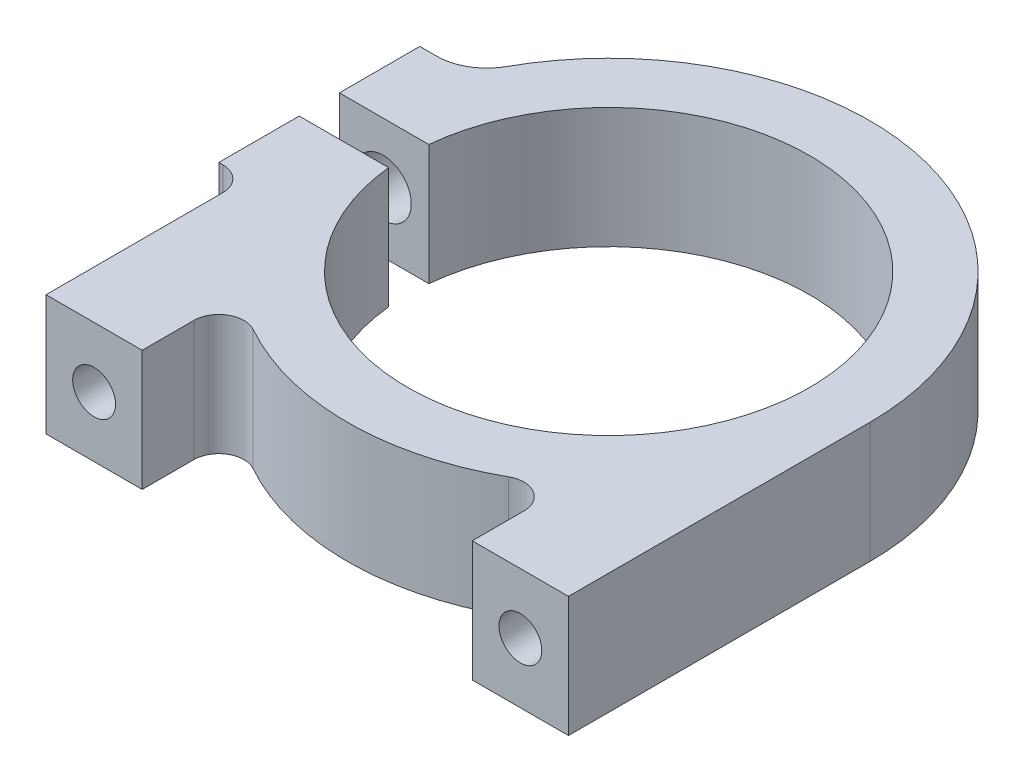
ISO-10303-21;
HEADER;
FILE_DESCRIPTION(('STEP AP214'),'2;1');
FILE_NAME('part.step','',(''),(''),'','','');
FILE_SCHEMA(('AUTOMOTIVE_DESIGN { 1 0 10303 214 1 1 1 1 }'));
ENDSEC;
DATA;
#1=APPLICATION_CONTEXT('core data for automotive mechanical design processes');
#2=APPLICATION_PROTOCOL_DEFINITION('international standard','automotive_design',2000,#1);
#3=PRODUCT_CONTEXT('',#1,'mechanical');
#4=PRODUCT('Part','Part','',(#3));
#5=PRODUCT_RELATED_PRODUCT_CATEGORY('part','',(#4));
#6=PRODUCT_DEFINITION_FORMATION('','',#4);
#7=PRODUCT_DEFINITION_CONTEXT('part definition',#1,'design');
#8=PRODUCT_DEFINITION('design','',#6,#7);
#9=PRODUCT_DEFINITION_SHAPE('','',#8);
#10=(LENGTH_UNIT() NAMED_UNIT(*) SI_UNIT(.MILLI.,.METRE.));
#11=(NAMED_UNIT(*) PLANE_ANGLE_UNIT() SI_UNIT($,.RADIAN.));
#12=(NAMED_UNIT(*) SI_UNIT($,.STERADIAN.) SOLID_ANGLE_UNIT());
#13=UNCERTAINTY_MEASURE_WITH_UNIT(LENGTH_MEASURE(1.E-05),#10,'distance_accuracy_value','');
#14=(GEOMETRIC_REPRESENTATION_CONTEXT(3) GLOBAL_UNCERTAINTY_ASSIGNED_CONTEXT((#13)) GLOBAL_UNIT_ASSIGNED_CONTEXT((#10,
#11,#12)) REPRESENTATION_CONTEXT('',''));
#15=CARTESIAN_POINT('',(0.,0.,0.));
#16=DIRECTION('',(0.,0.,1.));
#17=DIRECTION('',(1.,0.,0.));
#18=AXIS2_PLACEMENT_3D('',#15,#16,#17);
#19=CARTESIAN_POINT('',(-18.288,0.,0.));
#20=DIRECTION('',(1.,0.,0.));
#21=DIRECTION('',(0.,0.,-1.));
#22=AXIS2_PLACEMENT_3D('',#19,#20,#21);
#23=PLANE('',#22);
#24=DIRECTION('',(0.,0.,1.));
#25=VECTOR('',#24,1.);
#26=CARTESIAN_POINT('',(-18.288,0.,19.05));
#27=LINE('',#26,#25);
#28=CARTESIAN_POINT('',(-18.288,0.,-6.35));
#29=VERTEX_POINT('',#28);
#30=CARTESIAN_POINT('',(-18.288,0.,-1.27));
#31=VERTEX_POINT('',#30);
#32=EDGE_CURVE('E354',#29,#31,#27,.T.);
#33=ORIENTED_EDGE('',*,*,#32,.T.);
#34=DIRECTION('',(0.,1.,0.));
#35=VECTOR('',#34,1.);
#36=CARTESIAN_POINT('',(-18.288,0.,-1.27));
#37=LINE('',#36,#35);
#38=CARTESIAN_POINT('',(-18.288,7.62,-1.27));
#39=VERTEX_POINT('',#38);
#40=EDGE_CURVE('E253',#31,#39,#37,.T.);
#41=ORIENTED_EDGE('',*,*,#40,.T.);
#42=DIRECTION('',(0.,0.,1.));
#43=VECTOR('',#42,1.);
#44=CARTESIAN_POINT('',(-18.288,7.62,19.05));
#45=LINE('',#44,#43);
#46=CARTESIAN_POINT('',(-18.288,7.62,-6.35));
#47=VERTEX_POINT('',#46);
#48=EDGE_CURVE('E341',#47,#39,#45,.T.);
#49=ORIENTED_EDGE('',*,*,#48,.F.);
#50=DIRECTION('',(0.,-1.,0.));
#51=VECTOR('',#50,1.);
#52=CARTESIAN_POINT('',(-18.288,0.,-6.35));
#53=LINE('',#52,#51);
#54=EDGE_CURVE('E350',#47,#29,#53,.T.);
#55=ORIENTED_EDGE('',*,*,#54,.T.);
#56=EDGE_LOOP('',(#33,#41,#49,#55));
#57=FACE_BOUND('',#56,.T.);
#58=ADVANCED_FACE('F43',(#57),#23,.F.);
#59=CARTESIAN_POINT('',(0.,0.,19.05));
#60=DIRECTION('',(0.,0.,-1.));
#61=DIRECTION('',(-1.,0.,0.));
#62=AXIS2_PLACEMENT_3D('',#59,#60,#61);
#63=PLANE('',#62);
#64=CARTESIAN_POINT('',(-13.4703841816038,3.81,19.05));
#65=DIRECTION('',(0.,0.,1.));
#66=DIRECTION('',(1.,0.,0.));
#67=AXIS2_PLACEMENT_3D('',#64,#65,#66);
#68=CIRCLE('',#67,1.35254999999998);
#69=CARTESIAN_POINT('',(-12.1178341816038,3.81,19.05));
#70=VERTEX_POINT('',#69);
#71=EDGE_CURVE('E213',#70,#70,#68,.T.);
#72=ORIENTED_EDGE('',*,*,#71,.F.);
#73=EDGE_LOOP('',(#72));
#74=FACE_BOUND('',#73,.T.);
#75=DIRECTION('',(1.,0.,0.));
#76=VECTOR('',#75,1.);
#77=CARTESIAN_POINT('',(16.51,7.62,19.05));
#78=LINE('',#77,#76);
#79=CARTESIAN_POINT('',(-16.51,7.62,19.05));
#80=VERTEX_POINT('',#79);
#81=CARTESIAN_POINT('',(-10.42924,7.62,19.05));
#82=VERTEX_POINT('',#81);
#83=EDGE_CURVE('E345',#80,#82,#78,.T.);
#84=ORIENTED_EDGE('',*,*,#83,.F.);
#85=DIRECTION('',(0.,1.,0.));
#86=VECTOR('',#85,1.);
#87=CARTESIAN_POINT('',(-16.51,0.,19.05));
#88=LINE('',#87,#86);
#89=CARTESIAN_POINT('',(-16.51,0.,19.05));
#90=VERTEX_POINT('',#89);
#91=EDGE_CURVE('E283',#90,#80,#88,.T.);
#92=ORIENTED_EDGE('',*,*,#91,.F.);
#93=DIRECTION('',(1.,0.,0.));
#94=VECTOR('',#93,1.);
#95=CARTESIAN_POINT('',(16.51,0.,19.05));
#96=LINE('',#95,#94);
#97=CARTESIAN_POINT('',(-10.42924,0.,19.05));
#98=VERTEX_POINT('',#97);
#99=EDGE_CURVE('E358',#90,#98,#96,.T.);
#100=ORIENTED_EDGE('',*,*,#99,.T.);
#101=DIRECTION('',(0.,1.,0.));
#102=VECTOR('',#101,1.);
#103=CARTESIAN_POINT('',(-10.42924,0.,19.05));
#104=LINE('',#103,#102);
#105=EDGE_CURVE('E306',#98,#82,#104,.T.);
#106=ORIENTED_EDGE('',*,*,#105,.T.);
#107=EDGE_LOOP('',(#84,#92,#100,#106));
#108=FACE_BOUND('',#107,.T.);
#109=ADVANCED_FACE('F630',(#74,#108),#63,.F.);
#110=CARTESIAN_POINT('',(0.,-5.92424712516283,-6.35000000000001));
#111=DIRECTION('',(0.,0.,1.));
#112=DIRECTION('',(1.,0.,0.));
#113=AXIS2_PLACEMENT_3D('',#110,#111,#112);
#114=PLANE('',#113);
#115=CARTESIAN_POINT('',(-15.52194,3.81,-6.35));
#116=DIRECTION('',(0.,0.,-1.));
#117=DIRECTION('',(-1.,0.,0.));
#118=AXIS2_PLACEMENT_3D('',#115,#116,#117);
#119=CIRCLE('',#118,1.77799999999998);
#120=CARTESIAN_POINT('',(-17.29994,3.81,-6.35));
#121=VERTEX_POINT('',#120);
#122=EDGE_CURVE('E230',#121,#121,#119,.T.);
#123=ORIENTED_EDGE('',*,*,#122,.F.);
#124=EDGE_LOOP('',(#123));
#125=FACE_BOUND('',#124,.T.);
#126=CARTESIAN_POINT('',(-15.52194,3.81,-6.35));
#127=DIRECTION('',(0.,0.,1.));
#128=DIRECTION('',(1.,0.,0.));
#129=AXIS2_PLACEMENT_3D('',#126,#127,#128);
#130=CIRCLE('',#129,3.1115);
#131=CARTESIAN_POINT('',(-17.2271181571382,1.20734756403802,-6.35));
#132=VERTEX_POINT('',#131);
#133=CARTESIAN_POINT('',(-15.24,6.90870006396231,-6.35));
#134=VERTEX_POINT('',#133);
#135=EDGE_CURVE('E58',#132,#134,#130,.T.);
#136=ORIENTED_EDGE('',*,*,#135,.F.);
#137=DIRECTION('',(0.,-1.,0.));
#138=VECTOR('',#137,1.);
#139=CARTESIAN_POINT('',(-17.2271181571382,-5.92424712516283,-6.35));
#140=LINE('',#139,#138);
#141=CARTESIAN_POINT('',(-17.2271181571382,0.,-6.34999999999998));
#142=VERTEX_POINT('',#141);
#143=EDGE_CURVE('E612',#132,#142,#140,.T.);
#144=ORIENTED_EDGE('',*,*,#143,.T.);
#145=DIRECTION('',(1.,0.,0.));
#146=VECTOR('',#145,1.);
#147=CARTESIAN_POINT('',(-15.24,0.,-6.35));
#148=LINE('',#147,#146);
#149=EDGE_CURVE('E368',#29,#142,#148,.T.);
#150=ORIENTED_EDGE('',*,*,#149,.F.);
#151=ORIENTED_EDGE('',*,*,#54,.F.);
#152=DIRECTION('',(-1.,0.,0.));
#153=VECTOR('',#152,1.);
#154=CARTESIAN_POINT('',(-18.288,7.62,-6.35));
#155=LINE('',#154,#153);
#156=CARTESIAN_POINT('',(-17.2271181571382,7.62,-6.35));
#157=VERTEX_POINT('',#156);
#158=EDGE_CURVE('E338',#157,#47,#155,.T.);
#159=ORIENTED_EDGE('',*,*,#158,.F.);
#160=DIRECTION('',(0.,-1.,0.));
#161=VECTOR('',#160,1.);
#162=CARTESIAN_POINT('',(-17.2271181571382,-5.92424712516283,-6.35));
#163=LINE('',#162,#161);
#164=CARTESIAN_POINT('',(-17.2271181571382,6.9215,-6.35));
#165=VERTEX_POINT('',#164);
#166=EDGE_CURVE('E609',#157,#165,#163,.T.);
#167=ORIENTED_EDGE('',*,*,#166,.T.);
#168=DIRECTION('',(1.,0.,0.));
#169=VECTOR('',#168,1.);
#170=CARTESIAN_POINT('',(0.,6.9215,-6.35000000000001));
#171=LINE('',#170,#169);
#172=CARTESIAN_POINT('',(-15.52194,6.9215,-6.35));
#173=VERTEX_POINT('',#172);
#174=EDGE_CURVE('E607',#165,#173,#171,.T.);
#175=ORIENTED_EDGE('',*,*,#174,.T.);
#176=EDGE_CURVE('E449',#134,#173,#130,.T.);
#177=ORIENTED_EDGE('',*,*,#176,.F.);
#178=EDGE_LOOP('',(#136,#144,#150,#151,#159,#167,#175,#177));
#179=FACE_BOUND('',#178,.T.);
#180=ADVANCED_FACE('F627',(#125,#179),#114,.F.);
#181=CARTESIAN_POINT('',(0.,7.62,0.));
#182=DIRECTION('',(0.,-1.,0.));
#183=DIRECTION('',(0.,0.,-1.));
#184=AXIS2_PLACEMENT_3D('',#181,#182,#183);
#185=CYLINDRICAL_SURFACE('',#184,16.51);
#186=CARTESIAN_POINT('',(0.,0.,0.));
#187=DIRECTION('',(0.,-1.,0.));
#188=DIRECTION('',(0.,0.,1.));
#189=AXIS2_PLACEMENT_3D('',#186,#187,#188);
#190=CIRCLE('',#189,16.51);
#191=CARTESIAN_POINT('',(-14.4485507124385,0.,-7.98870967741936));
#192=VERTEX_POINT('',#191);
#193=CARTESIAN_POINT('',(16.51,0.,0.));
#194=VERTEX_POINT('',#193);
#195=EDGE_CURVE('E366',#192,#194,#190,.T.);
#196=ORIENTED_EDGE('',*,*,#195,.F.);
#197=DIRECTION('',(0.,-1.,0.));
#198=VECTOR('',#197,1.);
#199=CARTESIAN_POINT('',(-14.4485507124385,7.62,-7.98870967741936));
#200=LINE('',#199,#198);
#201=CARTESIAN_POINT('',(-14.4485507124385,0.889508998927032,-7.98870967741936));
#202=VERTEX_POINT('',#201);
#203=EDGE_CURVE('E604',#192,#202,#200,.F.);
#204=ORIENTED_EDGE('',*,*,#203,.T.);
#205=CARTESIAN_POINT('',(-15.52194,0.698499999999998,-5.62578693485633));
#206=CARTESIAN_POINT('',(-15.4854731339468,0.698501935198527,-5.72640178156838));
#207=CARTESIAN_POINT('',(-15.4480285974644,0.69914085929907,-5.82665954634316));
#208=CARTESIAN_POINT('',(-15.3712011060332,0.701915400420493,-6.02641939895405));
#209=CARTESIAN_POINT('',(-15.3318179624468,0.704051163361149,-6.12592141215946));
#210=CARTESIAN_POINT('',(-15.2106768864915,0.713046610535485,-6.42349717554516));
#211=CARTESIAN_POINT('',(-15.1260359831156,0.722495780826319,-6.62034081475627));
#212=CARTESIAN_POINT('',(-14.9468649019323,0.75072169890199,-7.01568023187725));
#213=CARTESIAN_POINT('',(-14.8521205006136,0.76975857320611,-7.21406105926228));
#214=CARTESIAN_POINT('',(-14.6554690209219,0.819856649529013,-7.60560697659743));
#215=CARTESIAN_POINT('',(-14.5535663919439,0.850910435294968,-7.79877520500814));
#216=CARTESIAN_POINT('',(-14.3595494275865,0.9222214640834,-8.14968004072023));
#217=CARTESIAN_POINT('',(-14.2683121497909,0.96035307355544,-8.30832771265046));
#218=CARTESIAN_POINT('',(-14.0822534115297,1.04967488154899,-8.61992773006835));
#219=CARTESIAN_POINT('',(-13.9874302518527,1.10087133875475,-8.77287730554011));
#220=CARTESIAN_POINT('',(-13.7967412399011,1.21818243562499,-9.06977436141784));
#221=CARTESIAN_POINT('',(-13.7008978732906,1.28412913625055,-9.21380152659813));
#222=CARTESIAN_POINT('',(-13.5094500807721,1.43385484181993,-9.49227674828532));
#223=CARTESIAN_POINT('',(-13.4138455100027,1.51760780905324,-9.6267384131404));
#224=CARTESIAN_POINT('',(-13.2365611111634,1.69519940127717,-9.86881340706386));
#225=CARTESIAN_POINT('',(-13.1545224753835,1.78685207129358,-9.97774640400457));
#226=CARTESIAN_POINT('',(-12.996299262153,1.98818890453879,-10.1829808278039));
#227=CARTESIAN_POINT('',(-12.9201214643911,2.09789350291981,-10.2792677142872));
#228=CARTESIAN_POINT('',(-12.7772807105275,2.33762783682913,-10.4563037337745));
#229=CARTESIAN_POINT('',(-12.7107388187093,2.467879277736,-10.5368589768487));
#230=CARTESIAN_POINT('',(-12.6232878352005,2.67644661705286,-10.6411837741476));
#231=CARTESIAN_POINT('',(-12.5962046351142,2.7481418993286,-10.6731996099616));
#232=CARTESIAN_POINT('',(-12.5468475198645,2.8955079943709,-10.7311767730148));
#233=CARTESIAN_POINT('',(-12.5245719125048,2.97117739661182,-10.7571402308536));
#234=CARTESIAN_POINT('',(-12.4744795290881,3.16971065975737,-10.8152528518619));
#235=CARTESIAN_POINT('',(-12.450648244193,3.29507343818656,-10.842602478196));
#236=CARTESIAN_POINT('',(-12.4186330826282,3.55029101457252,-10.8792585437766));
#237=CARTESIAN_POINT('',(-12.410438788011,3.68014276304775,-10.888576996123));
#238=CARTESIAN_POINT('',(-12.4104412127409,3.93993779721104,-10.8885742406293));
#239=CARTESIAN_POINT('',(-12.4186481038264,4.06988108971105,-10.8792414656128));
#240=CARTESIAN_POINT('',(-12.4506891198985,4.32519988926556,-10.8425555602648));
#241=CARTESIAN_POINT('',(-12.4745298905957,4.45057342985745,-10.815194766489));
#242=CARTESIAN_POINT('',(-12.5355616535082,4.69229431706295,-10.7443906067067));
#243=CARTESIAN_POINT('',(-12.5726724718238,4.80869087354691,-10.701043775554));
#244=CARTESIAN_POINT('',(-12.6575604300473,5.03104704827857,-10.6004995421567));
#245=CARTESIAN_POINT('',(-12.7053417729742,5.13700253011818,-10.543296681399));
#246=CARTESIAN_POINT('',(-12.8285594920242,5.37569694377296,-10.3933028350189));
#247=CARTESIAN_POINT('',(-12.9075964945359,5.50326005145146,-10.2952563560163));
#248=CARTESIAN_POINT('',(-13.0745661498142,5.73678785555393,-10.0823692291421));
#249=CARTESIAN_POINT('',(-13.1625186030926,5.84270282819026,-9.96749093566345));
#250=CARTESIAN_POINT('',(-13.3203855676183,6.01100486649576,-9.75502194917827));
#251=CARTESIAN_POINT('',(-13.3894277950024,6.07769461852777,-9.66011039948918));
#252=CARTESIAN_POINT('',(-13.5284513079876,6.20082935415329,-9.46443363653409));
#253=CARTESIAN_POINT('',(-13.5984331200514,6.25726831281466,-9.36366502639403));
#254=CARTESIAN_POINT('',(-13.7382257859873,6.36095544800978,-9.15733602313892));
#255=CARTESIAN_POINT('',(-13.8080365054791,6.40819785127885,-9.05177267100614));
#256=CARTESIAN_POINT('',(-13.9466143605487,6.49448145996615,-8.83676430956491));
#257=CARTESIAN_POINT('',(-14.0153818148847,6.53352521919709,-8.72732052143447));
#258=CARTESIAN_POINT('',(-14.1458476590917,6.60155346436489,-8.51407335114997));
#259=CARTESIAN_POINT('',(-14.2076707247308,6.63109352331868,-8.41052139939679));
#260=CARTESIAN_POINT('',(-14.3295036379936,6.68470807727247,-8.20122382523562));
#261=CARTESIAN_POINT('',(-14.3895163435949,6.70879162513591,-8.09548215872386));
#262=CARTESIAN_POINT('',(-14.5518362553677,6.76845586575748,-7.80190233252084));
#263=CARTESIAN_POINT('',(-14.6521270688316,6.79912268111244,-7.61193962071112));
#264=CARTESIAN_POINT('',(-14.8457885817442,6.84878933086103,-7.22697450196913));
#265=CARTESIAN_POINT('',(-14.9391553112033,6.86778251685641,-7.03196928897042));
#266=CARTESIAN_POINT('',(-15.1187451427038,6.89661114338037,-6.63708412002955));
#267=CARTESIAN_POINT('',(-15.2049372228497,6.90640852535362,-6.4371873880516));
#268=CARTESIAN_POINT('',(-15.3694193041687,6.9188534923508,-6.03394419503236));
#269=CARTESIAN_POINT('',(-15.447708246365,6.9215001204341,-5.83059727593784));
#270=CARTESIAN_POINT('',(-15.5964919856263,6.92149987904635,-5.42009305243084));
#271=CARTESIAN_POINT('',(-15.6669517021781,6.91883012444324,-5.21292309452853));
#272=CARTESIAN_POINT('',(-15.7995650941259,6.90980153948929,-4.7960089518498));
#273=CARTESIAN_POINT('',(-15.8617179987305,6.90344236708842,-4.58626453015706));
#274=CARTESIAN_POINT('',(-15.9771442662327,6.88856964177688,-4.16629240786288));
#275=CARTESIAN_POINT('',(-16.0304867177044,6.88007431334647,-3.95608300151204));
#276=CARTESIAN_POINT('',(-16.1288330264427,6.86214123416271,-3.53381376626691));
#277=CARTESIAN_POINT('',(-16.1738388451176,6.85270370589242,-3.3217543849526));
#278=CARTESIAN_POINT('',(-16.2146510364849,6.84341122664435,-3.10888915289983));
#279=B_SPLINE_CURVE_WITH_KNOTS('',3,(#205,#206,#207,#208,#209,#210,#211,#212,#213,#214,#215,
#216,#217,#218,#219,#220,#221,#222,#223,#224,#225,#226,#227,#228,#229,#230,#231,#232,#233,#234,
#235,#236,#237,#238,#239,#240,#241,#242,#243,#244,#245,#246,#247,#248,#249,#250,#251,#252,#253,
#254,#255,#256,#257,#258,#259,#260,#261,#262,#263,#264,#265,#266,#267,#268,#269,#270,#271,#272,
#273,#274,#275,#276,#277,#278),.UNSPECIFIED.,.F.,.F.,(4,2,2,2,2,2,2,2,2,2,2,2,2,2,2,2,2,2,2,2,2,
2,2,2,2,2,2,2,2,2,2,2,2,2,2,2,4),(0.,0.321044843708941,0.642120988923724,1.28522901489469,
1.94680948495497,2.60798230924182,3.16832940357913,3.72894543642441,4.28347704413504,
4.83720328215382,5.32880159982016,5.82096029438146,6.31884729005702,6.56762858894505,
6.81632217743627,7.2055950302454,7.59460844426166,7.98386319270059,8.37328351442394,
8.76038975410506,9.14764874106464,9.68245135557348,10.2184688901509,10.6229008925865,
11.027569837202,11.4324920048673,11.8372878547669,12.209624373644,12.5813385524531,
13.2316834536493,13.8823983987253,14.5357947257388,15.1892784883614,15.8455813465377,
16.5019450610084,17.1528885398903,17.8036786724265),.UNSPECIFIED.);
#280=EDGE_CURVE('E377',#202,#134,#279,.T.);
#281=ORIENTED_EDGE('',*,*,#280,.T.);
#282=CARTESIAN_POINT('',(-15.52194,6.9215,-5.62578693485633));
#283=VERTEX_POINT('',#282);
#284=EDGE_CURVE('E378',#134,#283,#279,.T.);
#285=ORIENTED_EDGE('',*,*,#284,.T.);
#286=CARTESIAN_POINT('',(0.,6.9215,0.));
#287=DIRECTION('',(0.,-1.,0.));
#288=DIRECTION('',(0.,0.,-1.));
#289=AXIS2_PLACEMENT_3D('',#286,#287,#288);
#290=CIRCLE('',#289,16.51);
#291=CARTESIAN_POINT('',(-14.4485507124385,6.9215,-7.98870967741936));
#292=VERTEX_POINT('',#291);
#293=EDGE_CURVE('E347',#292,#283,#290,.F.);
#294=ORIENTED_EDGE('',*,*,#293,.F.);
#295=DIRECTION('',(0.,-1.,0.));
#296=VECTOR('',#295,1.);
#297=CARTESIAN_POINT('',(-14.4485507124385,7.62,-7.98870967741936));
#298=LINE('',#297,#296);
#299=CARTESIAN_POINT('',(-14.4485507124385,7.62,-7.98870967741935));
#300=VERTEX_POINT('',#299);
#301=EDGE_CURVE('E602',#292,#300,#298,.F.);
#302=ORIENTED_EDGE('',*,*,#301,.T.);
#303=CARTESIAN_POINT('',(0.,7.62,0.));
#304=DIRECTION('',(0.,1.,0.));
#305=DIRECTION('',(0.,0.,-1.));
#306=AXIS2_PLACEMENT_3D('',#303,#304,#305);
#307=CIRCLE('',#306,16.51);
#308=CARTESIAN_POINT('',(16.51,7.62,0.));
#309=VERTEX_POINT('',#308);
#310=EDGE_CURVE('E335',#309,#300,#307,.T.);
#311=ORIENTED_EDGE('',*,*,#310,.F.);
#312=DIRECTION('',(0.,-1.,0.));
#313=VECTOR('',#312,1.);
#314=CARTESIAN_POINT('',(16.51,7.62,0.));
#315=LINE('',#314,#313);
#316=EDGE_CURVE('E372',#309,#194,#315,.T.);
#317=ORIENTED_EDGE('',*,*,#316,.T.);
#318=EDGE_LOOP('',(#196,#204,#281,#285,#294,#302,#311,#317));
#319=FACE_BOUND('',#318,.T.);
#320=ADVANCED_FACE('F629',(#319),#185,.T.);
#321=CARTESIAN_POINT('',(-15.52194,3.81,-16.51));
#322=DIRECTION('',(0.,0.,1.));
#323=DIRECTION('',(1.,0.,0.));
#324=AXIS2_PLACEMENT_3D('',#321,#322,#323);
#325=CYLINDRICAL_SURFACE('',#324,3.1115);
#326=ORIENTED_EDGE('',*,*,#284,.F.);
#327=ORIENTED_EDGE('',*,*,#176,.T.);
#328=DIRECTION('',(0.,0.,1.));
#329=VECTOR('',#328,1.);
#330=CARTESIAN_POINT('',(-15.52194,6.9215,-16.51));
#331=LINE('',#330,#329);
#332=EDGE_CURVE('E371',#283,#173,#331,.F.);
#333=ORIENTED_EDGE('',*,*,#332,.F.);
#334=EDGE_LOOP('',(#326,#327,#333));
#335=FACE_BOUND('',#334,.T.);
#336=ADVANCED_FACE('F636',(#335),#325,.T.);
#337=ORIENTED_EDGE('',*,*,#135,.T.);
#338=ORIENTED_EDGE('',*,*,#280,.F.);
#339=CARTESIAN_POINT('',(-14.4485507124385,0.889508998927032,-7.98870967741936));
#340=CARTESIAN_POINT('',(-14.4886987378315,0.874760879645998,-7.91612332464799));
#341=CARTESIAN_POINT('',(-14.5316371216836,0.859912671676937,-7.84516262749067));
#342=CARTESIAN_POINT('',(-14.6230441560755,0.830782375128718,-7.70666406522509));
#343=CARTESIAN_POINT('',(-14.6715186881576,0.816500910761228,-7.63912995254409));
#344=CARTESIAN_POINT('',(-14.8259249169088,0.775470407790247,-7.44100881868331));
#345=CARTESIAN_POINT('',(-14.9401355354262,0.750820398016488,-7.31617990170038));
#346=CARTESIAN_POINT('',(-15.1262301950829,0.723120724605173,-7.14294910224273));
#347=CARTESIAN_POINT('',(-15.1909447634434,0.715424248572022,-7.08739332337228));
#348=CARTESIAN_POINT('',(-15.3248522914516,0.704022758928312,-6.98152283696505));
#349=CARTESIAN_POINT('',(-15.3940428487065,0.700315622660214,-6.93120535510949));
#350=CARTESIAN_POINT('',(-15.5360014998013,0.697725638682116,-6.83650620935903));
#351=CARTESIAN_POINT('',(-15.6087514693995,0.698820446558317,-6.79209804145587));
#352=CARTESIAN_POINT('',(-15.7573645297366,0.706528077748045,-6.70938747967627));
#353=CARTESIAN_POINT('',(-15.8332268756484,0.713139588091549,-6.67108363555968));
#354=CARTESIAN_POINT('',(-15.9771256489235,0.731234967524523,-6.6054860195793));
#355=CARTESIAN_POINT('',(-16.0448994741688,0.741974861079356,-6.57740846039323));
#356=CARTESIAN_POINT('',(-16.1813701010614,0.768386533110929,-6.52627636040613));
#357=CARTESIAN_POINT('',(-16.2500667661653,0.784057589502231,-6.50322108501249));
#358=CARTESIAN_POINT('',(-16.387711816861,0.820527519413352,-6.46212762517247));
#359=CARTESIAN_POINT('',(-16.4566604185544,0.841333403191999,-6.44409637196259));
#360=CARTESIAN_POINT('',(-16.5938956268064,0.888082564057313,-6.41298979842455));
#361=CARTESIAN_POINT('',(-16.6621824066349,0.914024456177342,-6.39991314481194));
#362=CARTESIAN_POINT('',(-16.8159504393406,0.978799951369908,-6.37552952798496));
#363=CARTESIAN_POINT('',(-16.9010092972413,1.01921780999546,-6.36569228538282));
#364=CARTESIAN_POINT('',(-17.0256994444814,1.08559940557659,-6.35612086684779));
#365=CARTESIAN_POINT('',(-17.0667313770473,1.10865403563149,-6.3537941588719));
#366=CARTESIAN_POINT('',(-17.1477410905054,1.1566216572003,-6.35073396745706));
#367=CARTESIAN_POINT('',(-17.1877191523694,1.18153414646866,-6.35000005503207));
#368=CARTESIAN_POINT('',(-17.2271181571382,1.20734756403802,-6.35));
#369=B_SPLINE_CURVE_WITH_KNOTS('',3,(#339,#340,#341,#342,#343,#344,#345,#346,#347,#348,#349,
#350,#351,#352,#353,#354,#355,#356,#357,#358,#359,#360,#361,#362,#363,#364,#365,#366,#367,#368),
.UNSPECIFIED.,.F.,.F.,(4,2,2,2,2,2,2,2,2,2,2,2,2,2,4),(0.,0.252579824676068,0.505430528279235,
1.01554305298503,1.27216740732666,1.52865514874507,1.78395067039063,2.03918544926583,
2.261284851101,2.48335174535613,2.70572350722992,2.92803538621414,3.21133737351597,
3.35264309569458,3.49391075541777),.UNSPECIFIED.);
#370=EDGE_CURVE('E614',#202,#132,#369,.T.);
#371=ORIENTED_EDGE('',*,*,#370,.T.);
#372=EDGE_LOOP('',(#337,#338,#371));
#373=FACE_BOUND('',#372,.T.);
#374=ADVANCED_FACE('F620',(#373),#325,.F.);
#375=CARTESIAN_POINT('',(0.,0.,0.));
#376=DIRECTION('',(0.,1.,0.));
#377=DIRECTION('',(0.,0.,1.));
#378=AXIS2_PLACEMENT_3D('',#375,#376,#377);
#379=PLANE('',#378);
#380=DIRECTION('',(1.,0.,0.));
#381=VECTOR('',#380,1.);
#382=CARTESIAN_POINT('',(-18.288,0.,1.27));
#383=LINE('',#382,#381);
#384=CARTESIAN_POINT('',(-18.288,0.,1.27));
#385=VERTEX_POINT('',#384);
#386=CARTESIAN_POINT('',(-12.6363404512541,0.,1.27));
#387=VERTEX_POINT('',#386);
#388=EDGE_CURVE('E242',#385,#387,#383,.T.);
#389=ORIENTED_EDGE('',*,*,#388,.T.);
#390=CARTESIAN_POINT('',(0.,0.,0.));
#391=DIRECTION('',(0.,1.,0.));
#392=DIRECTION('',(0.,0.,1.));
#393=AXIS2_PLACEMENT_3D('',#390,#391,#392);
#394=CIRCLE('',#393,12.7);
#395=CARTESIAN_POINT('',(-12.6363404512541,0.,-1.27));
#396=VERTEX_POINT('',#395);
#397=EDGE_CURVE('E238',#387,#396,#394,.T.);
#398=ORIENTED_EDGE('',*,*,#397,.T.);
#399=DIRECTION('',(-1.,0.,0.));
#400=VECTOR('',#399,1.);
#401=CARTESIAN_POINT('',(-12.6363404512541,0.,-1.27));
#402=LINE('',#401,#400);
#403=EDGE_CURVE('E245',#396,#31,#402,.T.);
#404=ORIENTED_EDGE('',*,*,#403,.T.);
#405=ORIENTED_EDGE('',*,*,#32,.F.);
#406=ORIENTED_EDGE('',*,*,#149,.T.);
#407=CARTESIAN_POINT('',(-17.2271181571382,0.,-9.525));
#408=DIRECTION('',(0.,1.,0.));
#409=DIRECTION('',(0.,0.,1.));
#410=AXIS2_PLACEMENT_3D('',#407,#408,#409);
#411=CIRCLE('',#410,3.175);
#412=EDGE_CURVE('E619',#142,#192,#411,.T.);
#413=ORIENTED_EDGE('',*,*,#412,.T.);
#414=ORIENTED_EDGE('',*,*,#195,.T.);
#415=DIRECTION('',(0.,0.,-1.));
#416=VECTOR('',#415,1.);
#417=CARTESIAN_POINT('',(16.51,0.,19.05));
#418=LINE('',#417,#416);
#419=CARTESIAN_POINT('',(16.51,0.,19.05));
#420=VERTEX_POINT('',#419);
#421=EDGE_CURVE('E363',#420,#194,#418,.T.);
#422=ORIENTED_EDGE('',*,*,#421,.F.);
#423=CARTESIAN_POINT('',(10.42924,0.,19.05));
#424=VERTEX_POINT('',#423);
#425=EDGE_CURVE('E357',#424,#420,#96,.T.);
#426=ORIENTED_EDGE('',*,*,#425,.F.);
#427=DIRECTION('',(0.,0.,-1.));
#428=VECTOR('',#427,1.);
#429=CARTESIAN_POINT('',(10.42924,0.,19.05));
#430=LINE('',#429,#428);
#431=CARTESIAN_POINT('',(10.42924,0.,15.7862689918549));
#432=VERTEX_POINT('',#431);
#433=EDGE_CURVE('E293',#424,#432,#430,.T.);
#434=ORIENTED_EDGE('',*,*,#433,.T.);
#435=CARTESIAN_POINT('',(8.84428,0.,15.7862689918549));
#436=DIRECTION('',(0.,1.,0.));
#437=DIRECTION('',(0.,0.,1.));
#438=AXIS2_PLACEMENT_3D('',#435,#436,#437);
#439=CIRCLE('',#438,1.58496);
#440=CARTESIAN_POINT('',(8.06959854014598,0.,14.4035301020574));
#441=VERTEX_POINT('',#440);
#442=EDGE_CURVE('E297',#432,#441,#439,.T.);
#443=ORIENTED_EDGE('',*,*,#442,.T.);
#444=CARTESIAN_POINT('',(0.,0.,0.));
#445=DIRECTION('',(0.,-1.,0.));
#446=DIRECTION('',(0.,0.,-1.));
#447=AXIS2_PLACEMENT_3D('',#444,#445,#446);
#448=CIRCLE('',#447,16.51);
#449=CARTESIAN_POINT('',(-8.06959854014599,0.,14.4035301020574));
#450=VERTEX_POINT('',#449);
#451=EDGE_CURVE('E300',#441,#450,#448,.T.);
#452=ORIENTED_EDGE('',*,*,#451,.T.);
#453=CARTESIAN_POINT('',(-8.84428,0.,15.7862689918549));
#454=DIRECTION('',(0.,1.,0.));
#455=DIRECTION('',(0.,0.,1.));
#456=AXIS2_PLACEMENT_3D('',#453,#454,#455);
#457=CIRCLE('',#456,1.58496);
#458=CARTESIAN_POINT('',(-10.42924,0.,15.7862689918549));
#459=VERTEX_POINT('',#458);
#460=EDGE_CURVE('E303',#450,#459,#457,.T.);
#461=ORIENTED_EDGE('',*,*,#460,.T.);
#462=DIRECTION('',(0.,0.,1.));
#463=VECTOR('',#462,1.);
#464=CARTESIAN_POINT('',(-10.42924,0.,15.7862689918549));
#465=LINE('',#464,#463);
#466=EDGE_CURVE('E290',#459,#98,#465,.T.);
#467=ORIENTED_EDGE('',*,*,#466,.T.);
#468=ORIENTED_EDGE('',*,*,#99,.F.);
#469=DIRECTION('',(0.,0.,-1.));
#470=VECTOR('',#469,1.);
#471=CARTESIAN_POINT('',(-16.51,0.,19.05));
#472=LINE('',#471,#470);
#473=CARTESIAN_POINT('',(-16.51,0.,7.874));
#474=VERTEX_POINT('',#473);
#475=EDGE_CURVE('E270',#90,#474,#472,.T.);
#476=ORIENTED_EDGE('',*,*,#475,.T.);
#477=CARTESIAN_POINT('',(-18.034,0.,7.874));
#478=DIRECTION('',(0.,1.,0.));
#479=DIRECTION('',(0.,0.,1.));
#480=AXIS2_PLACEMENT_3D('',#477,#478,#479);
#481=CIRCLE('',#480,1.524);
#482=CARTESIAN_POINT('',(-18.034,0.,6.35));
#483=VERTEX_POINT('',#482);
#484=EDGE_CURVE('E263',#474,#483,#481,.T.);
#485=ORIENTED_EDGE('',*,*,#484,.T.);
#486=DIRECTION('',(-1.,0.,0.));
#487=VECTOR('',#486,1.);
#488=CARTESIAN_POINT('',(-18.034,0.,6.35));
#489=LINE('',#488,#487);
#490=CARTESIAN_POINT('',(-18.288,0.,6.35));
#491=VERTEX_POINT('',#490);
#492=EDGE_CURVE('E266',#483,#491,#489,.T.);
#493=ORIENTED_EDGE('',*,*,#492,.T.);
#494=EDGE_CURVE('E353',#385,#491,#27,.T.);
#495=ORIENTED_EDGE('',*,*,#494,.F.);
#496=EDGE_LOOP('',(#389,#398,#404,#405,#406,#413,#414,#422,#426,#434,#443,#452,#461,#467,#468,
#476,#485,#493,#495));
#497=FACE_BOUND('',#496,.T.);
#498=ADVANCED_FACE('F688',(#497),#379,.F.);
#499=CARTESIAN_POINT('',(16.51,6.9215,19.05));
#500=DIRECTION('',(-1.,0.,0.));
#501=DIRECTION('',(0.,0.,1.));
#502=AXIS2_PLACEMENT_3D('',#499,#500,#501);
#503=PLANE('',#502);
#504=ORIENTED_EDGE('',*,*,#316,.F.);
#505=DIRECTION('',(0.,0.,-1.));
#506=VECTOR('',#505,1.);
#507=CARTESIAN_POINT('',(16.51,7.62,0.));
#508=LINE('',#507,#506);
#509=CARTESIAN_POINT('',(16.51,7.62,19.05));
#510=VERTEX_POINT('',#509);
#511=EDGE_CURVE('E322',#510,#309,#508,.T.);
#512=ORIENTED_EDGE('',*,*,#511,.F.);
#513=DIRECTION('',(0.,1.,0.));
#514=VECTOR('',#513,1.);
#515=CARTESIAN_POINT('',(16.51,6.9215,19.05));
#516=LINE('',#515,#514);
#517=EDGE_CURVE('E360',#420,#510,#516,.T.);
#518=ORIENTED_EDGE('',*,*,#517,.F.);
#519=ORIENTED_EDGE('',*,*,#421,.T.);
#520=EDGE_LOOP('',(#504,#512,#518,#519));
#521=FACE_BOUND('',#520,.T.);
#522=ADVANCED_FACE('F659',(#521),#503,.F.);
#523=CARTESIAN_POINT('',(13.4703841816038,3.81,19.05));
#524=DIRECTION('',(0.,0.,1.));
#525=DIRECTION('',(1.,0.,0.));
#526=AXIS2_PLACEMENT_3D('',#523,#524,#525);
#527=CIRCLE('',#526,1.35254999999998);
#528=CARTESIAN_POINT('',(14.8229341816037,3.81,19.05));
#529=VERTEX_POINT('',#528);
#530=EDGE_CURVE('E224',#529,#529,#527,.T.);
#531=ORIENTED_EDGE('',*,*,#530,.F.);
#532=EDGE_LOOP('',(#531));
#533=FACE_BOUND('',#532,.T.);
#534=CARTESIAN_POINT('',(10.42924,7.62,19.05));
#535=VERTEX_POINT('',#534);
#536=EDGE_CURVE('E344',#535,#510,#78,.T.);
#537=ORIENTED_EDGE('',*,*,#536,.F.);
#538=DIRECTION('',(0.,1.,0.));
#539=VECTOR('',#538,1.);
#540=CARTESIAN_POINT('',(10.42924,0.,19.05));
#541=LINE('',#540,#539);
#542=EDGE_CURVE('E329',#424,#535,#541,.T.);
#543=ORIENTED_EDGE('',*,*,#542,.F.);
#544=ORIENTED_EDGE('',*,*,#425,.T.);
#545=ORIENTED_EDGE('',*,*,#517,.T.);
#546=EDGE_LOOP('',(#537,#543,#544,#545));
#547=FACE_BOUND('',#546,.T.);
#548=ADVANCED_FACE('F640',(#533,#547),#63,.F.);
#549=CARTESIAN_POINT('',(-18.288,7.62,1.27));
#550=VERTEX_POINT('',#549);
#551=CARTESIAN_POINT('',(-18.288,7.62,6.35));
#552=VERTEX_POINT('',#551);
#553=EDGE_CURVE('E340',#550,#552,#45,.T.);
#554=ORIENTED_EDGE('',*,*,#553,.F.);
#555=DIRECTION('',(0.,1.,0.));
#556=VECTOR('',#555,1.);
#557=CARTESIAN_POINT('',(-18.288,0.,1.27));
#558=LINE('',#557,#556);
#559=EDGE_CURVE('E249',#385,#550,#558,.T.);
#560=ORIENTED_EDGE('',*,*,#559,.F.);
#561=ORIENTED_EDGE('',*,*,#494,.T.);
#562=DIRECTION('',(0.,1.,0.));
#563=VECTOR('',#562,1.);
#564=CARTESIAN_POINT('',(-18.288,0.,6.35));
#565=LINE('',#564,#563);
#566=EDGE_CURVE('E285',#491,#552,#565,.T.);
#567=ORIENTED_EDGE('',*,*,#566,.T.);
#568=EDGE_LOOP('',(#554,#560,#561,#567));
#569=FACE_BOUND('',#568,.T.);
#570=ADVANCED_FACE('F645',(#569),#23,.F.);
#571=CARTESIAN_POINT('',(0.,7.62,0.));
#572=DIRECTION('',(0.,-1.,0.));
#573=DIRECTION('',(0.,0.,-1.));
#574=AXIS2_PLACEMENT_3D('',#571,#572,#573);
#575=PLANE('',#574);
#576=DIRECTION('',(-1.,0.,0.));
#577=VECTOR('',#576,1.);
#578=CARTESIAN_POINT('',(-12.6363404512541,7.62,-1.27));
#579=LINE('',#578,#577);
#580=CARTESIAN_POINT('',(-12.6363404512541,7.62,-1.27));
#581=VERTEX_POINT('',#580);
#582=EDGE_CURVE('E246',#581,#39,#579,.T.);
#583=ORIENTED_EDGE('',*,*,#582,.F.);
#584=CARTESIAN_POINT('',(0.,7.62,0.));
#585=DIRECTION('',(0.,1.,0.));
#586=DIRECTION('',(0.,0.,1.));
#587=AXIS2_PLACEMENT_3D('',#584,#585,#586);
#588=CIRCLE('',#587,12.7);
#589=CARTESIAN_POINT('',(-12.6363404512541,7.62,1.27));
#590=VERTEX_POINT('',#589);
#591=EDGE_CURVE('E236',#590,#581,#588,.T.);
#592=ORIENTED_EDGE('',*,*,#591,.F.);
#593=DIRECTION('',(1.,0.,0.));
#594=VECTOR('',#593,1.);
#595=CARTESIAN_POINT('',(-18.288,7.62,1.27));
#596=LINE('',#595,#594);
#597=EDGE_CURVE('E241',#550,#590,#596,.T.);
#598=ORIENTED_EDGE('',*,*,#597,.F.);
#599=ORIENTED_EDGE('',*,*,#553,.T.);
#600=DIRECTION('',(-1.,0.,0.));
#601=VECTOR('',#600,1.);
#602=CARTESIAN_POINT('',(-18.034,7.62,6.35));
#603=LINE('',#602,#601);
#604=CARTESIAN_POINT('',(-18.034,7.62,6.35));
#605=VERTEX_POINT('',#604);
#606=EDGE_CURVE('E275',#605,#552,#603,.T.);
#607=ORIENTED_EDGE('',*,*,#606,.F.);
#608=CARTESIAN_POINT('',(-18.034,7.62,7.874));
#609=DIRECTION('',(0.,1.,0.));
#610=DIRECTION('',(0.,0.,1.));
#611=AXIS2_PLACEMENT_3D('',#608,#609,#610);
#612=CIRCLE('',#611,1.524);
#613=CARTESIAN_POINT('',(-16.51,7.62,7.874));
#614=VERTEX_POINT('',#613);
#615=EDGE_CURVE('E256',#614,#605,#612,.T.);
#616=ORIENTED_EDGE('',*,*,#615,.F.);
#617=DIRECTION('',(0.,0.,-1.));
#618=VECTOR('',#617,1.);
#619=CARTESIAN_POINT('',(-16.51,7.62,19.05));
#620=LINE('',#619,#618);
#621=EDGE_CURVE('E267',#80,#614,#620,.T.);
#622=ORIENTED_EDGE('',*,*,#621,.F.);
#623=ORIENTED_EDGE('',*,*,#83,.T.);
#624=DIRECTION('',(0.,0.,1.));
#625=VECTOR('',#624,1.);
#626=CARTESIAN_POINT('',(-10.42924,7.62,15.7862689918549));
#627=LINE('',#626,#625);
#628=CARTESIAN_POINT('',(-10.42924,7.62,15.7862689918549));
#629=VERTEX_POINT('',#628);
#630=EDGE_CURVE('E282',#629,#82,#627,.T.);
#631=ORIENTED_EDGE('',*,*,#630,.F.);
#632=CARTESIAN_POINT('',(-8.84428,7.62,15.7862689918549));
#633=DIRECTION('',(0.,1.,0.));
#634=DIRECTION('',(0.,0.,1.));
#635=AXIS2_PLACEMENT_3D('',#632,#633,#634);
#636=CIRCLE('',#635,1.58496);
#637=CARTESIAN_POINT('',(-8.06959854014599,7.62,14.4035301020574));
#638=VERTEX_POINT('',#637);
#639=EDGE_CURVE('E294',#638,#629,#636,.T.);
#640=ORIENTED_EDGE('',*,*,#639,.F.);
#641=CARTESIAN_POINT('',(0.,7.62,0.));
#642=DIRECTION('',(0.,-1.,0.));
#643=DIRECTION('',(0.,0.,-1.));
#644=AXIS2_PLACEMENT_3D('',#641,#642,#643);
#645=CIRCLE('',#644,16.51);
#646=CARTESIAN_POINT('',(8.06959854014598,7.62,14.4035301020574));
#647=VERTEX_POINT('',#646);
#648=EDGE_CURVE('E315',#647,#638,#645,.T.);
#649=ORIENTED_EDGE('',*,*,#648,.F.);
#650=CARTESIAN_POINT('',(8.84428,7.62,15.7862689918549));
#651=DIRECTION('',(0.,1.,0.));
#652=DIRECTION('',(0.,0.,1.));
#653=AXIS2_PLACEMENT_3D('',#650,#651,#652);
#654=CIRCLE('',#653,1.58496);
#655=CARTESIAN_POINT('',(10.42924,7.62,15.7862689918549));
#656=VERTEX_POINT('',#655);
#657=EDGE_CURVE('E312',#656,#647,#654,.T.);
#658=ORIENTED_EDGE('',*,*,#657,.F.);
#659=DIRECTION('',(0.,0.,-1.));
#660=VECTOR('',#659,1.);
#661=CARTESIAN_POINT('',(10.42924,7.62,19.05));
#662=LINE('',#661,#660);
#663=EDGE_CURVE('E309',#535,#656,#662,.T.);
#664=ORIENTED_EDGE('',*,*,#663,.F.);
#665=ORIENTED_EDGE('',*,*,#536,.T.);
#666=ORIENTED_EDGE('',*,*,#511,.T.);
#667=ORIENTED_EDGE('',*,*,#310,.T.);
#668=CARTESIAN_POINT('',(-17.2271181571382,7.62,-9.525));
#669=DIRECTION('',(0.,-1.,0.));
#670=DIRECTION('',(0.,0.,-1.));
#671=AXIS2_PLACEMENT_3D('',#668,#669,#670);
#672=CIRCLE('',#671,3.175);
#673=EDGE_CURVE('E12',#300,#157,#672,.T.);
#674=ORIENTED_EDGE('',*,*,#673,.T.);
#675=ORIENTED_EDGE('',*,*,#158,.T.);
#676=ORIENTED_EDGE('',*,*,#48,.T.);
#677=EDGE_LOOP('',(#583,#592,#598,#599,#607,#616,#622,#623,#631,#640,#649,#658,#664,#665,#666,
#667,#674,#675,#676));
#678=FACE_BOUND('',#677,.T.);
#679=ADVANCED_FACE('F650',(#678),#575,.F.);
#680=CARTESIAN_POINT('',(0.,6.9215,0.));
#681=DIRECTION('',(0.,-1.,0.));
#682=DIRECTION('',(0.,0.,-1.));
#683=AXIS2_PLACEMENT_3D('',#680,#681,#682);
#684=PLANE('',#683);
#685=ORIENTED_EDGE('',*,*,#332,.T.);
#686=ORIENTED_EDGE('',*,*,#174,.F.);
#687=CARTESIAN_POINT('',(-17.2271181571382,6.9215,-9.525));
#688=DIRECTION('',(0.,-1.,0.));
#689=DIRECTION('',(0.,0.,-1.));
#690=AXIS2_PLACEMENT_3D('',#687,#688,#689);
#691=CIRCLE('',#690,3.175);
#692=EDGE_CURVE('E51',#165,#292,#691,.F.);
#693=ORIENTED_EDGE('',*,*,#692,.T.);
#694=ORIENTED_EDGE('',*,*,#293,.T.);
#695=EDGE_LOOP('',(#685,#686,#693,#694));
#696=FACE_BOUND('',#695,.T.);
#697=ADVANCED_FACE('F656',(#696),#684,.T.);
#698=CARTESIAN_POINT('',(-10.42924,0.,15.7862689918549));
#699=DIRECTION('',(-1.,0.,0.));
#700=DIRECTION('',(0.,0.,1.));
#701=AXIS2_PLACEMENT_3D('',#698,#699,#700);
#702=PLANE('',#701);
#703=ORIENTED_EDGE('',*,*,#630,.T.);
#704=ORIENTED_EDGE('',*,*,#105,.F.);
#705=ORIENTED_EDGE('',*,*,#466,.F.);
#706=DIRECTION('',(0.,1.,0.));
#707=VECTOR('',#706,1.);
#708=CARTESIAN_POINT('',(-10.42924,0.,15.7862689918549));
#709=LINE('',#708,#707);
#710=EDGE_CURVE('E320',#459,#629,#709,.T.);
#711=ORIENTED_EDGE('',*,*,#710,.T.);
#712=EDGE_LOOP('',(#703,#704,#705,#711));
#713=FACE_BOUND('',#712,.T.);
#714=ADVANCED_FACE('F686',(#713),#702,.F.);
#715=CARTESIAN_POINT('',(-8.84428,0.,15.7862689918549));
#716=DIRECTION('',(0.,1.,0.));
#717=DIRECTION('',(0.,0.,1.));
#718=AXIS2_PLACEMENT_3D('',#715,#716,#717);
#719=CYLINDRICAL_SURFACE('',#718,1.58496);
#720=ORIENTED_EDGE('',*,*,#639,.T.);
#721=ORIENTED_EDGE('',*,*,#710,.F.);
#722=ORIENTED_EDGE('',*,*,#460,.F.);
#723=DIRECTION('',(0.,1.,0.));
#724=VECTOR('',#723,1.);
#725=CARTESIAN_POINT('',(-8.06959854014599,0.,14.4035301020574));
#726=LINE('',#725,#724);
#727=EDGE_CURVE('E323',#450,#638,#726,.T.);
#728=ORIENTED_EDGE('',*,*,#727,.T.);
#729=EDGE_LOOP('',(#720,#721,#722,#728));
#730=FACE_BOUND('',#729,.T.);
#731=ADVANCED_FACE('F692',(#730),#719,.F.);
#732=CARTESIAN_POINT('',(0.,0.,0.));
#733=DIRECTION('',(0.,1.,0.));
#734=DIRECTION('',(0.,0.,1.));
#735=AXIS2_PLACEMENT_3D('',#732,#733,#734);
#736=CYLINDRICAL_SURFACE('',#735,16.51);
#737=ORIENTED_EDGE('',*,*,#648,.T.);
#738=ORIENTED_EDGE('',*,*,#727,.F.);
#739=ORIENTED_EDGE('',*,*,#451,.F.);
#740=DIRECTION('',(0.,1.,0.));
#741=VECTOR('',#740,1.);
#742=CARTESIAN_POINT('',(8.06959854014598,0.,14.4035301020574));
#743=LINE('',#742,#741);
#744=EDGE_CURVE('E325',#441,#647,#743,.T.);
#745=ORIENTED_EDGE('',*,*,#744,.T.);
#746=EDGE_LOOP('',(#737,#738,#739,#745));
#747=FACE_BOUND('',#746,.T.);
#748=ADVANCED_FACE('F698',(#747),#736,.T.);
#749=CARTESIAN_POINT('',(8.84428,0.,15.7862689918549));
#750=DIRECTION('',(0.,1.,0.));
#751=DIRECTION('',(0.,0.,1.));
#752=AXIS2_PLACEMENT_3D('',#749,#750,#751);
#753=CYLINDRICAL_SURFACE('',#752,1.58496);
#754=ORIENTED_EDGE('',*,*,#657,.T.);
#755=ORIENTED_EDGE('',*,*,#744,.F.);
#756=ORIENTED_EDGE('',*,*,#442,.F.);
#757=DIRECTION('',(0.,1.,0.));
#758=VECTOR('',#757,1.);
#759=CARTESIAN_POINT('',(10.42924,0.,15.7862689918549));
#760=LINE('',#759,#758);
#761=EDGE_CURVE('E327',#432,#656,#760,.T.);
#762=ORIENTED_EDGE('',*,*,#761,.T.);
#763=EDGE_LOOP('',(#754,#755,#756,#762));
#764=FACE_BOUND('',#763,.T.);
#765=ADVANCED_FACE('F701',(#764),#753,.F.);
#766=CARTESIAN_POINT('',(10.42924,0.,19.05));
#767=DIRECTION('',(1.,0.,0.));
#768=DIRECTION('',(0.,0.,-1.));
#769=AXIS2_PLACEMENT_3D('',#766,#767,#768);
#770=PLANE('',#769);
#771=ORIENTED_EDGE('',*,*,#663,.T.);
#772=ORIENTED_EDGE('',*,*,#761,.F.);
#773=ORIENTED_EDGE('',*,*,#433,.F.);
#774=ORIENTED_EDGE('',*,*,#542,.T.);
#775=EDGE_LOOP('',(#771,#772,#773,#774));
#776=FACE_BOUND('',#775,.T.);
#777=ADVANCED_FACE('F703',(#776),#770,.F.);
#778=CARTESIAN_POINT('',(-18.034,0.,7.874));
#779=DIRECTION('',(0.,1.,0.));
#780=DIRECTION('',(0.,0.,1.));
#781=AXIS2_PLACEMENT_3D('',#778,#779,#780);
#782=CYLINDRICAL_SURFACE('',#781,1.524);
#783=ORIENTED_EDGE('',*,*,#615,.T.);
#784=DIRECTION('',(0.,1.,0.));
#785=VECTOR('',#784,1.);
#786=CARTESIAN_POINT('',(-18.034,0.,6.35));
#787=LINE('',#786,#785);
#788=EDGE_CURVE('E273',#483,#605,#787,.T.);
#789=ORIENTED_EDGE('',*,*,#788,.F.);
#790=ORIENTED_EDGE('',*,*,#484,.F.);
#791=DIRECTION('',(0.,1.,0.));
#792=VECTOR('',#791,1.);
#793=CARTESIAN_POINT('',(-16.51,0.,7.874));
#794=LINE('',#793,#792);
#795=EDGE_CURVE('E280',#474,#614,#794,.T.);
#796=ORIENTED_EDGE('',*,*,#795,.T.);
#797=EDGE_LOOP('',(#783,#789,#790,#796));
#798=FACE_BOUND('',#797,.T.);
#799=ADVANCED_FACE('F675',(#798),#782,.F.);
#800=CARTESIAN_POINT('',(-16.51,0.,19.05));
#801=DIRECTION('',(1.,0.,0.));
#802=DIRECTION('',(0.,0.,-1.));
#803=AXIS2_PLACEMENT_3D('',#800,#801,#802);
#804=PLANE('',#803);
#805=ORIENTED_EDGE('',*,*,#621,.T.);
#806=ORIENTED_EDGE('',*,*,#795,.F.);
#807=ORIENTED_EDGE('',*,*,#475,.F.);
#808=ORIENTED_EDGE('',*,*,#91,.T.);
#809=EDGE_LOOP('',(#805,#806,#807,#808));
#810=FACE_BOUND('',#809,.T.);
#811=ADVANCED_FACE('F739',(#810),#804,.F.);
#812=CARTESIAN_POINT('',(-18.034,0.,6.35));
#813=DIRECTION('',(0.,0.,-1.));
#814=DIRECTION('',(-1.,0.,0.));
#815=AXIS2_PLACEMENT_3D('',#812,#813,#814);
#816=PLANE('',#815);
#817=ORIENTED_EDGE('',*,*,#606,.T.);
#818=ORIENTED_EDGE('',*,*,#566,.F.);
#819=ORIENTED_EDGE('',*,*,#492,.F.);
#820=ORIENTED_EDGE('',*,*,#788,.T.);
#821=EDGE_LOOP('',(#817,#818,#819,#820));
#822=FACE_BOUND('',#821,.T.);
#823=ADVANCED_FACE('F671',(#822),#816,.F.);
#824=CARTESIAN_POINT('',(-12.6363404512541,0.,-1.27));
#825=DIRECTION('',(0.,0.,-1.));
#826=DIRECTION('',(-1.,0.,0.));
#827=AXIS2_PLACEMENT_3D('',#824,#825,#826);
#828=PLANE('',#827);
#829=CARTESIAN_POINT('',(-15.52194,3.81,-1.27));
#830=DIRECTION('',(0.,0.,-1.));
#831=DIRECTION('',(-1.,0.,0.));
#832=AXIS2_PLACEMENT_3D('',#829,#830,#831);
#833=CIRCLE('',#832,1.77799999999999);
#834=CARTESIAN_POINT('',(-17.29994,3.81,-1.27));
#835=VERTEX_POINT('',#834);
#836=EDGE_CURVE('E233',#835,#835,#833,.T.);
#837=ORIENTED_EDGE('',*,*,#836,.T.);
#838=EDGE_LOOP('',(#837));
#839=FACE_BOUND('',#838,.T.);
#840=ORIENTED_EDGE('',*,*,#582,.T.);
#841=ORIENTED_EDGE('',*,*,#40,.F.);
#842=ORIENTED_EDGE('',*,*,#403,.F.);
#843=DIRECTION('',(0.,1.,0.));
#844=VECTOR('',#843,1.);
#845=CARTESIAN_POINT('',(-12.6363404512541,0.,-1.27));
#846=LINE('',#845,#844);
#847=EDGE_CURVE('E257',#396,#581,#846,.T.);
#848=ORIENTED_EDGE('',*,*,#847,.T.);
#849=EDGE_LOOP('',(#840,#841,#842,#848));
#850=FACE_BOUND('',#849,.T.);
#851=ADVANCED_FACE('F720',(#839,#850),#828,.F.);
#852=CARTESIAN_POINT('',(-18.288,0.,1.27));
#853=DIRECTION('',(0.,0.,1.));
#854=DIRECTION('',(1.,0.,0.));
#855=AXIS2_PLACEMENT_3D('',#852,#853,#854);
#856=PLANE('',#855);
#857=CARTESIAN_POINT('',(-15.52194,3.81,1.27));
#858=DIRECTION('',(0.,0.,-1.));
#859=DIRECTION('',(-1.,0.,0.));
#860=AXIS2_PLACEMENT_3D('',#857,#858,#859);
#861=CIRCLE('',#860,1.35254999999998);
#862=CARTESIAN_POINT('',(-16.87449,3.81,1.27));
#863=VERTEX_POINT('',#862);
#864=EDGE_CURVE('E214',#863,#863,#861,.T.);
#865=ORIENTED_EDGE('',*,*,#864,.F.);
#866=EDGE_LOOP('',(#865));
#867=FACE_BOUND('',#866,.T.);
#868=ORIENTED_EDGE('',*,*,#597,.T.);
#869=DIRECTION('',(0.,1.,0.));
#870=VECTOR('',#869,1.);
#871=CARTESIAN_POINT('',(-12.6363404512541,0.,1.27));
#872=LINE('',#871,#870);
#873=EDGE_CURVE('E260',#387,#590,#872,.T.);
#874=ORIENTED_EDGE('',*,*,#873,.F.);
#875=ORIENTED_EDGE('',*,*,#388,.F.);
#876=ORIENTED_EDGE('',*,*,#559,.T.);
#877=EDGE_LOOP('',(#868,#874,#875,#876));
#878=FACE_BOUND('',#877,.T.);
#879=ADVANCED_FACE('F725',(#867,#878),#856,.F.);
#880=CARTESIAN_POINT('',(0.,0.,0.));
#881=DIRECTION('',(0.,1.,0.));
#882=DIRECTION('',(0.,0.,1.));
#883=AXIS2_PLACEMENT_3D('',#880,#881,#882);
#884=CYLINDRICAL_SURFACE('',#883,12.7);
#885=ORIENTED_EDGE('',*,*,#397,.F.);
#886=ORIENTED_EDGE('',*,*,#873,.T.);
#887=ORIENTED_EDGE('',*,*,#591,.T.);
#888=ORIENTED_EDGE('',*,*,#847,.F.);
#889=EDGE_LOOP('',(#885,#886,#887,#888));
#890=FACE_BOUND('',#889,.T.);
#891=ADVANCED_FACE('F723',(#890),#884,.F.);
#892=CARTESIAN_POINT('',(-15.52194,3.81,-6.35));
#893=DIRECTION('',(0.,0.,-1.));
#894=DIRECTION('',(-1.,0.,0.));
#895=AXIS2_PLACEMENT_3D('',#892,#893,#894);
#896=CYLINDRICAL_SURFACE('',#895,1.77799999999999);
#897=ORIENTED_EDGE('',*,*,#836,.F.);
#898=EDGE_LOOP('',(#897));
#899=FACE_BOUND('',#898,.T.);
#900=ORIENTED_EDGE('',*,*,#122,.T.);
#901=EDGE_LOOP('',(#900));
#902=FACE_BOUND('',#901,.T.);
#903=ADVANCED_FACE('F733',(#899,#902),#896,.F.);
#904=CARTESIAN_POINT('',(13.4703841816038,3.81,11.43));
#905=DIRECTION('',(0.,0.,1.));
#906=DIRECTION('',(1.,0.,0.));
#907=AXIS2_PLACEMENT_3D('',#904,#905,#906);
#908=CONICAL_SURFACE('',#907,1.35254999999998,1.02974425854162);
#909=CARTESIAN_POINT('',(13.4703841816038,3.81,10.6173059694857));
#910=VERTEX_POINT('',#909);
#911=VERTEX_LOOP('',#910);
#912=FACE_BOUND('',#911,.T.);
#913=CARTESIAN_POINT('',(13.4703841816038,3.81,11.43));
#914=DIRECTION('',(0.,0.,1.));
#915=DIRECTION('',(1.,0.,0.));
#916=AXIS2_PLACEMENT_3D('',#913,#914,#915);
#917=CIRCLE('',#916,1.35254999999998);
#918=CARTESIAN_POINT('',(14.8229341816037,3.81,11.43));
#919=VERTEX_POINT('',#918);
#920=EDGE_CURVE('E227',#919,#919,#917,.T.);
#921=ORIENTED_EDGE('',*,*,#920,.T.);
#922=EDGE_LOOP('',(#921));
#923=FACE_BOUND('',#922,.T.);
#924=ADVANCED_FACE('F908',(#912,#923),#908,.F.);
#925=CARTESIAN_POINT('',(13.4703841816038,3.81,19.05));
#926=DIRECTION('',(0.,0.,1.));
#927=DIRECTION('',(1.,0.,0.));
#928=AXIS2_PLACEMENT_3D('',#925,#926,#927);
#929=CYLINDRICAL_SURFACE('',#928,1.35254999999998);
#930=ORIENTED_EDGE('',*,*,#920,.F.);
#931=EDGE_LOOP('',(#930));
#932=FACE_BOUND('',#931,.T.);
#933=ORIENTED_EDGE('',*,*,#530,.T.);
#934=EDGE_LOOP('',(#933));
#935=FACE_BOUND('',#934,.T.);
#936=ADVANCED_FACE('F913',(#932,#935),#929,.F.);
#937=CARTESIAN_POINT('',(-13.4703841816038,3.81,11.43));
#938=DIRECTION('',(0.,0.,1.));
#939=DIRECTION('',(1.,0.,0.));
#940=AXIS2_PLACEMENT_3D('',#937,#938,#939);
#941=CONICAL_SURFACE('',#940,1.35254999999998,1.02974425854162);
#942=CARTESIAN_POINT('',(-13.4703841816038,3.81,10.6173059694857));
#943=VERTEX_POINT('',#942);
#944=VERTEX_LOOP('',#943);
#945=FACE_BOUND('',#944,.T.);
#946=CARTESIAN_POINT('',(-13.4703841816038,3.81,11.43));
#947=DIRECTION('',(0.,0.,1.));
#948=DIRECTION('',(1.,0.,0.));
#949=AXIS2_PLACEMENT_3D('',#946,#947,#948);
#950=CIRCLE('',#949,1.35254999999998);
#951=CARTESIAN_POINT('',(-12.1178341816038,3.81,11.43));
#952=VERTEX_POINT('',#951);
#953=EDGE_CURVE('E217',#952,#952,#950,.T.);
#954=ORIENTED_EDGE('',*,*,#953,.T.);
#955=EDGE_LOOP('',(#954));
#956=FACE_BOUND('',#955,.T.);
#957=ADVANCED_FACE('F925',(#945,#956),#941,.F.);
#958=CARTESIAN_POINT('',(-13.4703841816038,3.81,19.05));
#959=DIRECTION('',(0.,0.,1.));
#960=DIRECTION('',(1.,0.,0.));
#961=AXIS2_PLACEMENT_3D('',#958,#959,#960);
#962=CYLINDRICAL_SURFACE('',#961,1.35254999999998);
#963=ORIENTED_EDGE('',*,*,#953,.F.);
#964=EDGE_LOOP('',(#963));
#965=FACE_BOUND('',#964,.T.);
#966=ORIENTED_EDGE('',*,*,#71,.T.);
#967=EDGE_LOOP('',(#966));
#968=FACE_BOUND('',#967,.T.);
#969=ADVANCED_FACE('F207',(#965,#968),#962,.F.);
#970=CARTESIAN_POINT('',(-15.52194,3.81,6.35));
#971=DIRECTION('',(0.,0.,-1.));
#972=DIRECTION('',(-1.,0.,0.));
#973=AXIS2_PLACEMENT_3D('',#970,#971,#972);
#974=CONICAL_SURFACE('',#973,1.35254999999998,1.02974425840096);
#975=CARTESIAN_POINT('',(-15.52194,3.81,7.16269403077324));
#976=VERTEX_POINT('',#975);
#977=VERTEX_LOOP('',#976);
#978=FACE_BOUND('',#977,.T.);
#979=CARTESIAN_POINT('',(-15.52194,3.81,6.35));
#980=DIRECTION('',(0.,0.,-1.));
#981=DIRECTION('',(-1.,0.,0.));
#982=AXIS2_PLACEMENT_3D('',#979,#980,#981);
#983=CIRCLE('',#982,1.35254999999998);
#984=CARTESIAN_POINT('',(-16.87449,3.81,6.35));
#985=VERTEX_POINT('',#984);
#986=EDGE_CURVE('E211',#985,#985,#983,.T.);
#987=ORIENTED_EDGE('',*,*,#986,.T.);
#988=EDGE_LOOP('',(#987));
#989=FACE_BOUND('',#988,.T.);
#990=ADVANCED_FACE('F203',(#978,#989),#974,.F.);
#991=CARTESIAN_POINT('',(-15.52194,3.81,1.27));
#992=DIRECTION('',(0.,0.,-1.));
#993=DIRECTION('',(-1.,0.,0.));
#994=AXIS2_PLACEMENT_3D('',#991,#992,#993);
#995=CYLINDRICAL_SURFACE('',#994,1.35254999999998);
#996=ORIENTED_EDGE('',*,*,#986,.F.);
#997=EDGE_LOOP('',(#996));
#998=FACE_BOUND('',#997,.T.);
#999=ORIENTED_EDGE('',*,*,#864,.T.);
#1000=EDGE_LOOP('',(#999));
#1001=FACE_BOUND('',#1000,.T.);
#1002=ADVANCED_FACE('F206',(#998,#1001),#995,.F.);
#1003=CARTESIAN_POINT('',(-17.2271181571382,7.62,-9.525));
#1004=DIRECTION('',(0.,-1.,0.));
#1005=DIRECTION('',(0.,0.,-1.));
#1006=AXIS2_PLACEMENT_3D('',#1003,#1004,#1005);
#1007=CYLINDRICAL_SURFACE('',#1006,3.175);
#1008=ORIENTED_EDGE('',*,*,#412,.F.);
#1009=ORIENTED_EDGE('',*,*,#143,.F.);
#1010=ORIENTED_EDGE('',*,*,#370,.F.);
#1011=ORIENTED_EDGE('',*,*,#203,.F.);
#1012=EDGE_LOOP('',(#1008,#1009,#1010,#1011));
#1013=FACE_BOUND('',#1012,.T.);
#1014=ADVANCED_FACE('F623',(#1013),#1007,.F.);
#1015=CARTESIAN_POINT('',(-17.2271181571382,7.62,-9.525));
#1016=DIRECTION('',(0.,-1.,0.));
#1017=DIRECTION('',(0.,0.,-1.));
#1018=AXIS2_PLACEMENT_3D('',#1015,#1016,#1017);
#1019=CYLINDRICAL_SURFACE('',#1018,3.175);
#1020=ORIENTED_EDGE('',*,*,#673,.F.);
#1021=ORIENTED_EDGE('',*,*,#301,.F.);
#1022=ORIENTED_EDGE('',*,*,#692,.F.);
#1023=ORIENTED_EDGE('',*,*,#166,.F.);
#1024=EDGE_LOOP('',(#1020,#1021,#1022,#1023));
#1025=FACE_BOUND('',#1024,.T.);
#1026=ADVANCED_FACE('F45',(#1025),#1019,.F.);
#1027=CLOSED_SHELL('',(#58,#109,#180,#320,#336,#374,#498,#522,#548,#570,#679,#697,#714,#731,
#748,#765,#777,#799,#811,#823,#851,#879,#891,#903,#924,#936,#957,#969,#990,#1002,#1014,#1026));
#1028=MANIFOLD_SOLID_BREP('B2',#1027);
#1029=ADVANCED_BREP_SHAPE_REPRESENTATION('',(#18,#1028),#14);
#1030=SHAPE_DEFINITION_REPRESENTATION(#9,#1029);
ENDSEC;
END-ISO-10303-21;
